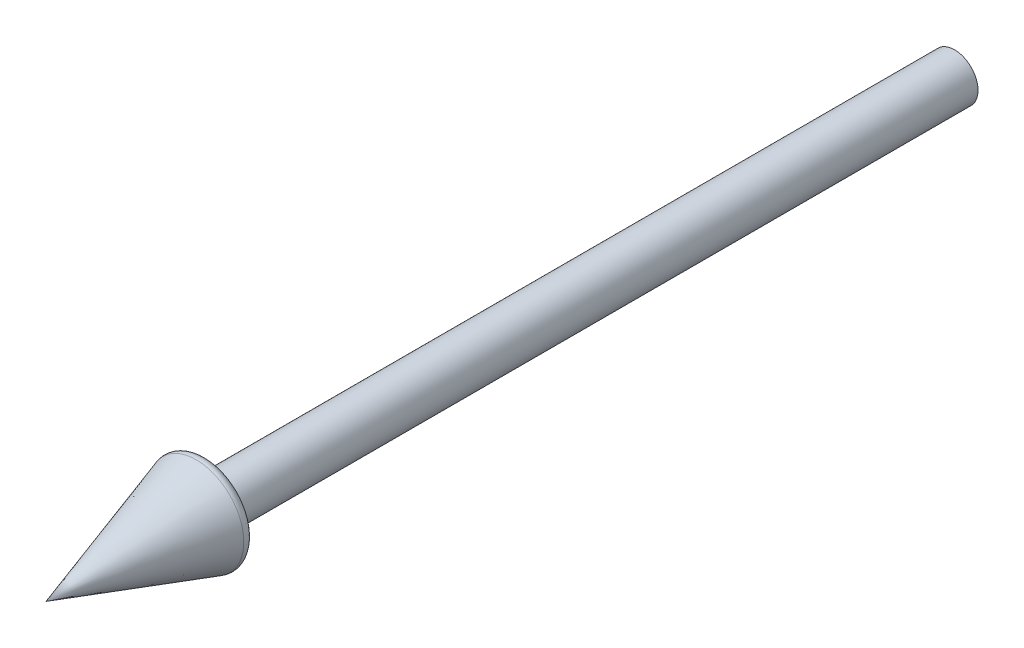
ISO-10303-21;
HEADER;
FILE_DESCRIPTION(('STEP AP214'),'2;1');
FILE_NAME('part.step','',(''),(''),'','','');
FILE_SCHEMA(('AUTOMOTIVE_DESIGN { 1 0 10303 214 1 1 1 1 }'));
ENDSEC;
DATA;
#1=APPLICATION_CONTEXT('core data for automotive mechanical design processes');
#2=APPLICATION_PROTOCOL_DEFINITION('international standard','automotive_design',2000,#1);
#3=PRODUCT_CONTEXT('',#1,'mechanical');
#4=PRODUCT('Part','Part','',(#3));
#5=PRODUCT_RELATED_PRODUCT_CATEGORY('part','',(#4));
#6=PRODUCT_DEFINITION_FORMATION('','',#4);
#7=PRODUCT_DEFINITION_CONTEXT('part definition',#1,'design');
#8=PRODUCT_DEFINITION('design','',#6,#7);
#9=PRODUCT_DEFINITION_SHAPE('','',#8);
#10=(LENGTH_UNIT() NAMED_UNIT(*) SI_UNIT(.MILLI.,.METRE.));
#11=(NAMED_UNIT(*) PLANE_ANGLE_UNIT() SI_UNIT($,.RADIAN.));
#12=(NAMED_UNIT(*) SI_UNIT($,.STERADIAN.) SOLID_ANGLE_UNIT());
#13=UNCERTAINTY_MEASURE_WITH_UNIT(LENGTH_MEASURE(1.E-05),#10,'distance_accuracy_value','');
#14=(GEOMETRIC_REPRESENTATION_CONTEXT(3) GLOBAL_UNCERTAINTY_ASSIGNED_CONTEXT((#13)) GLOBAL_UNIT_ASSIGNED_CONTEXT((#10,
#11,#12)) REPRESENTATION_CONTEXT('',''));
#15=CARTESIAN_POINT('',(0.,0.,0.));
#16=DIRECTION('',(0.,0.,1.));
#17=DIRECTION('',(1.,0.,0.));
#18=AXIS2_PLACEMENT_3D('',#15,#16,#17);
#19=CARTESIAN_POINT('',(31.4558812381217,0.,0.));
#20=DIRECTION('',(0.,0.,1.));
#21=DIRECTION('',(1.,0.,0.));
#22=AXIS2_PLACEMENT_3D('',#19,#20,#21);
#23=PLANE('',#22);
#24=CARTESIAN_POINT('',(0.,0.,0.));
#25=DIRECTION('',(0.,0.,-1.));
#26=DIRECTION('',(-1.,0.,0.));
#27=AXIS2_PLACEMENT_3D('',#24,#25,#26);
#28=CIRCLE('',#27,31.4558812381217);
#29=CARTESIAN_POINT('',(-31.4558812381217,0.,0.));
#30=VERTEX_POINT('',#29);
#31=EDGE_CURVE('E65',#30,#30,#28,.T.);
#32=ORIENTED_EDGE('',*,*,#31,.T.);
#33=EDGE_LOOP('',(#32));
#34=FACE_BOUND('',#33,.T.);
#35=ADVANCED_FACE('F31',(#34),#23,.F.);
#36=CARTESIAN_POINT('',(1.38777878078145E-13,0.,1219.18090331745));
#37=DIRECTION('',(0.,0.,-1.));
#38=DIRECTION('',(-1.,0.,0.));
#39=AXIS2_PLACEMENT_3D('',#36,#37,#38);
#40=CONICAL_SURFACE('',#39,0.,0.305979901046395);
#41=CARTESIAN_POINT('',(1.15818459498143E-13,0.,1017.47955817764));
#42=DIRECTION('',(0.,0.,-1.));
#43=DIRECTION('',(-1.,0.,0.));
#44=AXIS2_PLACEMENT_3D('',#41,#42,#43);
#45=CIRCLE('',#44,63.7175722893984);
#46=CARTESIAN_POINT('',(-63.7175722893983,0.,1017.47955817764));
#47=VERTEX_POINT('',#46);
#48=EDGE_CURVE('E11',#47,#47,#45,.T.);
#49=ORIENTED_EDGE('',*,*,#48,.F.);
#50=EDGE_LOOP('',(#49));
#51=FACE_BOUND('',#50,.T.);
#52=CARTESIAN_POINT('',(1.38777878078145E-13,0.,1219.18090331745));
#53=VERTEX_POINT('',#52);
#54=VERTEX_LOOP('',#53);
#55=FACE_BOUND('',#54,.T.);
#56=ADVANCED_FACE('F40',(#51,#55),#40,.T.);
#57=CARTESIAN_POINT('',(1.17961196366423E-13,0.,1014.46728111249));
#58=DIRECTION('',(0.,0.,-1.));
#59=DIRECTION('',(-1.,0.,0.));
#60=AXIS2_PLACEMENT_3D('',#57,#58,#59);
#61=TOROIDAL_SURFACE('',#60,54.1820499186641,9.99999999999999);
#62=CARTESIAN_POINT('',(1.14337287840063E-13,0.,1004.46728111249));
#63=DIRECTION('',(0.,0.,-1.));
#64=DIRECTION('',(-1.,0.,0.));
#65=AXIS2_PLACEMENT_3D('',#62,#63,#64);
#66=CIRCLE('',#65,54.1820499186641);
#67=CARTESIAN_POINT('',(-54.182049918664,0.,1004.46728111249));
#68=VERTEX_POINT('',#67);
#69=EDGE_CURVE('E37',#68,#68,#66,.T.);
#70=ORIENTED_EDGE('',*,*,#69,.F.);
#71=EDGE_LOOP('',(#70));
#72=FACE_BOUND('',#71,.T.);
#73=ORIENTED_EDGE('',*,*,#48,.T.);
#74=EDGE_LOOP('',(#73));
#75=FACE_BOUND('',#74,.T.);
#76=ADVANCED_FACE('F42',(#72,#75),#61,.T.);
#77=CARTESIAN_POINT('',(54.1820499186643,0.,1004.46728111249));
#78=DIRECTION('',(0.,0.,1.));
#79=DIRECTION('',(1.,0.,0.));
#80=AXIS2_PLACEMENT_3D('',#77,#78,#79);
#81=PLANE('',#80);
#82=CARTESIAN_POINT('',(1.14337287840063E-13,0.,1004.46728111249));
#83=DIRECTION('',(0.,0.,-1.));
#84=DIRECTION('',(-1.,0.,0.));
#85=AXIS2_PLACEMENT_3D('',#82,#83,#84);
#86=CIRCLE('',#85,31.4558812381216);
#87=CARTESIAN_POINT('',(-31.4558812381215,0.,1004.46728111249));
#88=VERTEX_POINT('',#87);
#89=EDGE_CURVE('E68',#88,#88,#86,.T.);
#90=ORIENTED_EDGE('',*,*,#89,.F.);
#91=EDGE_LOOP('',(#90));
#92=FACE_BOUND('',#91,.T.);
#93=ORIENTED_EDGE('',*,*,#69,.T.);
#94=EDGE_LOOP('',(#93));
#95=FACE_BOUND('',#94,.T.);
#96=ADVANCED_FACE('F48',(#92,#95),#81,.F.);
#97=CARTESIAN_POINT('',(0.,0.,0.));
#98=DIRECTION('',(0.,0.,-1.));
#99=DIRECTION('',(-1.,0.,0.));
#100=AXIS2_PLACEMENT_3D('',#97,#98,#99);
#101=CYLINDRICAL_SURFACE('',#100,31.4558812381217);
#102=ORIENTED_EDGE('',*,*,#31,.F.);
#103=EDGE_LOOP('',(#102));
#104=FACE_BOUND('',#103,.T.);
#105=ORIENTED_EDGE('',*,*,#89,.T.);
#106=EDGE_LOOP('',(#105));
#107=FACE_BOUND('',#106,.T.);
#108=ADVANCED_FACE('F56',(#104,#107),#101,.T.);
#109=CLOSED_SHELL('',(#35,#56,#76,#96,#108));
#110=MANIFOLD_SOLID_BREP('B2',#109);
#111=ADVANCED_BREP_SHAPE_REPRESENTATION('',(#18,#110),#14);
#112=SHAPE_DEFINITION_REPRESENTATION(#9,#111);
ENDSEC;
END-ISO-10303-21;
